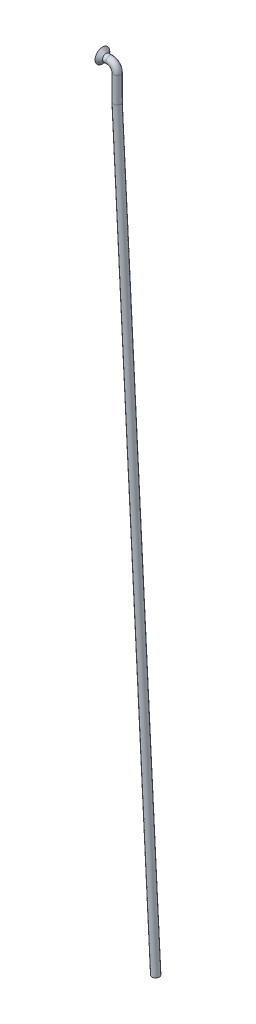
ISO-10303-21;
HEADER;
FILE_DESCRIPTION(('STEP AP214'),'2;1');
FILE_NAME('part.step','',(''),(''),'','','');
FILE_SCHEMA(('AUTOMOTIVE_DESIGN { 1 0 10303 214 1 1 1 1 }'));
ENDSEC;
DATA;
#1=APPLICATION_CONTEXT('core data for automotive mechanical design processes');
#2=APPLICATION_PROTOCOL_DEFINITION('international standard','automotive_design',2000,#1);
#3=PRODUCT_CONTEXT('',#1,'mechanical');
#4=PRODUCT('Part','Part','',(#3));
#5=PRODUCT_RELATED_PRODUCT_CATEGORY('part','',(#4));
#6=PRODUCT_DEFINITION_FORMATION('','',#4);
#7=PRODUCT_DEFINITION_CONTEXT('part definition',#1,'design');
#8=PRODUCT_DEFINITION('design','',#6,#7);
#9=PRODUCT_DEFINITION_SHAPE('','',#8);
#10=(LENGTH_UNIT() NAMED_UNIT(*) SI_UNIT(.MILLI.,.METRE.));
#11=(NAMED_UNIT(*) PLANE_ANGLE_UNIT() SI_UNIT($,.RADIAN.));
#12=(NAMED_UNIT(*) SI_UNIT($,.STERADIAN.) SOLID_ANGLE_UNIT());
#13=UNCERTAINTY_MEASURE_WITH_UNIT(LENGTH_MEASURE(1.E-05),#10,'distance_accuracy_value','');
#14=(GEOMETRIC_REPRESENTATION_CONTEXT(3) GLOBAL_UNCERTAINTY_ASSIGNED_CONTEXT((#13)) GLOBAL_UNIT_ASSIGNED_CONTEXT((#10,
#11,#12)) REPRESENTATION_CONTEXT('',''));
#15=CARTESIAN_POINT('',(0.,0.,0.));
#16=DIRECTION('',(0.,0.,1.));
#17=DIRECTION('',(1.,0.,0.));
#18=AXIS2_PLACEMENT_3D('',#15,#16,#17);
#19=CARTESIAN_POINT('',(0.,-9.00000000000002,0.));
#20=DIRECTION('',(0.0523359562429481,-0.998629534754575,0.));
#21=DIRECTION('',(0.998629534754573,0.0523359562429479,0.));
#22=AXIS2_PLACEMENT_3D('',#19,#20,#21);
#23=CYLINDRICAL_SURFACE('',#22,0.999999999999998);
#24=CARTESIAN_POINT('',(0.,-9.00000000000002,0.));
#25=DIRECTION('',(0.0261769483078754,-0.999657324975558,0.));
#26=DIRECTION('',(-0.999657324975557,-0.0261769483078752,0.));
#27=AXIS2_PLACEMENT_3D('',#24,#25,#26);
#28=ELLIPSE('',#27,1.00034279249087,0.999999999999998);
#29=CARTESIAN_POINT('',(-0.999999999999998,-9.02618592156921,0.));
#30=VERTEX_POINT('',#29);
#31=EDGE_CURVE('E32',#30,#30,#28,.F.);
#32=ORIENTED_EDGE('',*,*,#31,.F.);
#33=EDGE_LOOP('',(#32));
#34=FACE_BOUND('',#33,.T.);
#35=CARTESIAN_POINT('',(10.5201450800306,-209.736326246779,0.));
#36=DIRECTION('',(0.0523359562429481,-0.998629534754575,0.));
#37=DIRECTION('',(0.998629534754573,0.0523359562429479,0.));
#38=AXIS2_PLACEMENT_3D('',#35,#36,#37);
#39=CIRCLE('',#38,0.999999999999998);
#40=CARTESIAN_POINT('',(11.5187746147851,-209.683990290536,0.));
#41=VERTEX_POINT('',#40);
#42=EDGE_CURVE('E11',#41,#41,#39,.T.);
#43=ORIENTED_EDGE('',*,*,#42,.F.);
#44=EDGE_LOOP('',(#43));
#45=FACE_BOUND('',#44,.T.);
#46=ADVANCED_FACE('F26',(#34,#45),#23,.T.);
#47=CARTESIAN_POINT('',(0.,-2.,0.));
#48=DIRECTION('',(0.,-1.,0.));
#49=DIRECTION('',(1.,0.,0.));
#50=AXIS2_PLACEMENT_3D('',#47,#48,#49);
#51=CYLINDRICAL_SURFACE('',#50,0.999999999999998);
#52=CARTESIAN_POINT('',(0.,-2.,0.));
#53=DIRECTION('',(0.,-1.,0.));
#54=DIRECTION('',(0.,0.,-1.));
#55=AXIS2_PLACEMENT_3D('',#52,#53,#54);
#56=CIRCLE('',#55,0.999999999999998);
#57=CARTESIAN_POINT('',(0.999999999999995,-1.99999999999999,0.));
#58=VERTEX_POINT('',#57);
#59=EDGE_CURVE('E36',#58,#58,#56,.T.);
#60=ORIENTED_EDGE('',*,*,#59,.T.);
#61=EDGE_LOOP('',(#60));
#62=FACE_BOUND('',#61,.T.);
#63=ORIENTED_EDGE('',*,*,#31,.T.);
#64=EDGE_LOOP('',(#63));
#65=FACE_BOUND('',#64,.T.);
#66=ADVANCED_FACE('F69',(#62,#65),#51,.T.);
#67=CARTESIAN_POINT('',(-2.,-2.00000000000002,0.));
#68=DIRECTION('',(0.,0.,-1.));
#69=DIRECTION('',(-1.,0.,0.));
#70=AXIS2_PLACEMENT_3D('',#67,#68,#69);
#71=TOROIDAL_SURFACE('',#70,2.,0.999999999999998);
#72=CARTESIAN_POINT('',(-2.,0.,0.));
#73=DIRECTION('',(1.,0.,0.));
#74=DIRECTION('',(0.,0.,-1.));
#75=AXIS2_PLACEMENT_3D('',#72,#73,#74);
#76=CIRCLE('',#75,0.999999999999998);
#77=CARTESIAN_POINT('',(-2.,0.999999999999983,0.));
#78=VERTEX_POINT('',#77);
#79=EDGE_CURVE('E40',#78,#78,#76,.T.);
#80=CARTESIAN_POINT('',(-2.,-2.00000000000002,0.));
#81=DIRECTION('',(0.,0.,-1.));
#82=DIRECTION('',(-1.,0.,0.));
#83=AXIS2_PLACEMENT_3D('',#80,#81,#82);
#84=CIRCLE('',#83,3.);
#85=EDGE_CURVE('',#78,#58,#84,.T.);
#86=ORIENTED_EDGE('',*,*,#79,.T.);
#87=ORIENTED_EDGE('',*,*,#59,.F.);
#88=ORIENTED_EDGE('',*,*,#85,.T.);
#89=ORIENTED_EDGE('',*,*,#85,.F.);
#90=EDGE_LOOP('',(#86,#88,#87,#89));
#91=FACE_BOUND('',#90,.T.);
#92=ADVANCED_FACE('F74',(#91),#71,.T.);
#93=CARTESIAN_POINT('',(-2.,0.,0.));
#94=DIRECTION('',(-1.,0.,0.));
#95=DIRECTION('',(0.,-1.,0.));
#96=AXIS2_PLACEMENT_3D('',#93,#94,#95);
#97=CYLINDRICAL_SURFACE('',#96,0.999999999999998);
#98=CARTESIAN_POINT('',(-3.,0.,0.));
#99=DIRECTION('',(1.,0.,0.));
#100=DIRECTION('',(0.,1.,0.));
#101=AXIS2_PLACEMENT_3D('',#98,#99,#100);
#102=CIRCLE('',#101,0.999999999999999);
#103=CARTESIAN_POINT('',(-3.,1.,0.));
#104=VERTEX_POINT('',#103);
#105=EDGE_CURVE('E48',#104,#104,#102,.T.);
#106=ORIENTED_EDGE('',*,*,#105,.T.);
#107=EDGE_LOOP('',(#106));
#108=FACE_BOUND('',#107,.T.);
#109=ORIENTED_EDGE('',*,*,#79,.F.);
#110=EDGE_LOOP('',(#109));
#111=FACE_BOUND('',#110,.T.);
#112=ADVANCED_FACE('F52',(#108,#111),#97,.T.);
#113=CARTESIAN_POINT('',(10.5201450800306,-209.736326246779,0.));
#114=DIRECTION('',(0.0523359562429481,-0.998629534754575,0.));
#115=DIRECTION('',(0.998629534754573,0.0523359562429479,0.));
#116=AXIS2_PLACEMENT_3D('',#113,#114,#115);
#117=PLANE('',#116);
#118=ORIENTED_EDGE('',*,*,#42,.T.);
#119=EDGE_LOOP('',(#118));
#120=FACE_BOUND('',#119,.T.);
#121=ADVANCED_FACE('F58',(#120),#117,.T.);
#122=CARTESIAN_POINT('',(-3.,0.,0.));
#123=DIRECTION('',(-1.,0.,0.));
#124=DIRECTION('',(0.,-1.,0.));
#125=AXIS2_PLACEMENT_3D('',#122,#123,#124);
#126=CONICAL_SURFACE('',#125,0.999999999999999,0.785398163397449);
#127=CARTESIAN_POINT('',(-3.99999999999999,0.,0.));
#128=DIRECTION('',(1.,0.,0.));
#129=DIRECTION('',(0.,1.,0.));
#130=AXIS2_PLACEMENT_3D('',#127,#128,#129);
#131=CIRCLE('',#130,2.);
#132=CARTESIAN_POINT('',(-3.99999999999999,2.,0.));
#133=VERTEX_POINT('',#132);
#134=EDGE_CURVE('E45',#133,#133,#131,.T.);
#135=ORIENTED_EDGE('',*,*,#134,.T.);
#136=EDGE_LOOP('',(#135));
#137=FACE_BOUND('',#136,.T.);
#138=ORIENTED_EDGE('',*,*,#105,.F.);
#139=EDGE_LOOP('',(#138));
#140=FACE_BOUND('',#139,.T.);
#141=ADVANCED_FACE('F55',(#137,#140),#126,.T.);
#142=CARTESIAN_POINT('',(-3.99999999999999,0.,0.));
#143=DIRECTION('',(1.,0.,0.));
#144=DIRECTION('',(0.,0.,-1.));
#145=AXIS2_PLACEMENT_3D('',#142,#143,#144);
#146=PLANE('',#145);
#147=ORIENTED_EDGE('',*,*,#134,.F.);
#148=EDGE_LOOP('',(#147));
#149=FACE_BOUND('',#148,.T.);
#150=ADVANCED_FACE('F57',(#149),#146,.F.);
#151=CLOSED_SHELL('',(#46,#66,#92,#112,#121,#141,#150));
#152=MANIFOLD_SOLID_BREP('B2',#151);
#153=ADVANCED_BREP_SHAPE_REPRESENTATION('',(#18,#152),#14);
#154=SHAPE_DEFINITION_REPRESENTATION(#9,#153);
ENDSEC;
END-ISO-10303-21;
